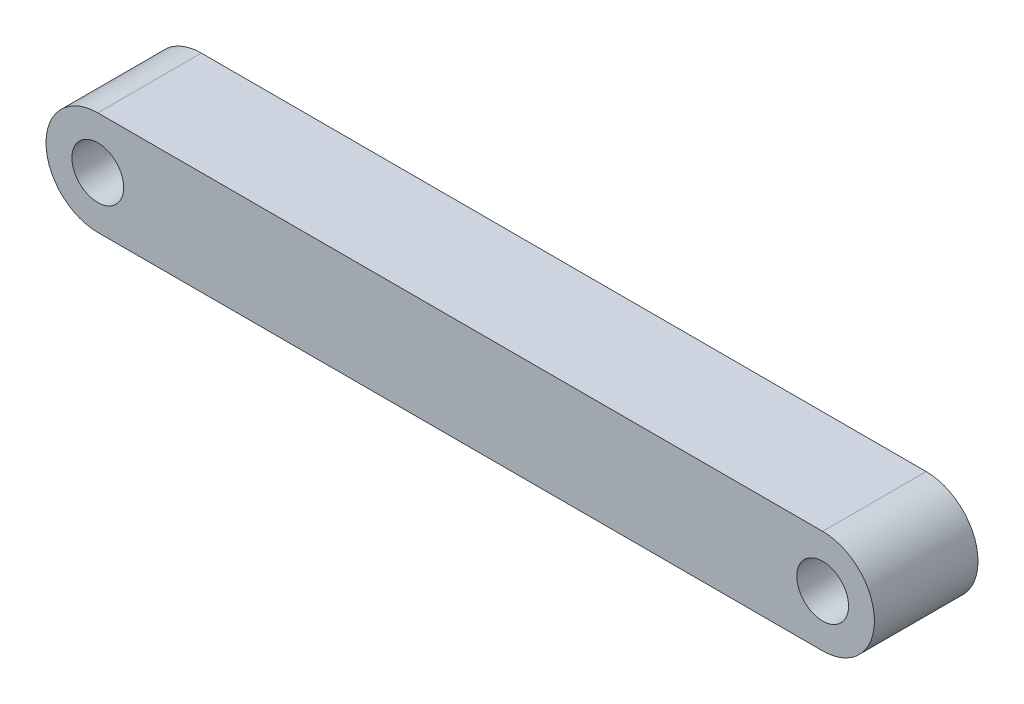
ISO-10303-21;
HEADER;
FILE_DESCRIPTION(('STEP AP214'),'2;1');
FILE_NAME('part.step','',(''),(''),'','','');
FILE_SCHEMA(('AUTOMOTIVE_DESIGN { 1 0 10303 214 1 1 1 1 }'));
ENDSEC;
DATA;
#1=APPLICATION_CONTEXT('core data for automotive mechanical design processes');
#2=APPLICATION_PROTOCOL_DEFINITION('international standard','automotive_design',2000,#1);
#3=PRODUCT_CONTEXT('',#1,'mechanical');
#4=PRODUCT('Part','Part','',(#3));
#5=PRODUCT_RELATED_PRODUCT_CATEGORY('part','',(#4));
#6=PRODUCT_DEFINITION_FORMATION('','',#4);
#7=PRODUCT_DEFINITION_CONTEXT('part definition',#1,'design');
#8=PRODUCT_DEFINITION('design','',#6,#7);
#9=PRODUCT_DEFINITION_SHAPE('','',#8);
#10=(LENGTH_UNIT() NAMED_UNIT(*) SI_UNIT(.MILLI.,.METRE.));
#11=(NAMED_UNIT(*) PLANE_ANGLE_UNIT() SI_UNIT($,.RADIAN.));
#12=(NAMED_UNIT(*) SI_UNIT($,.STERADIAN.) SOLID_ANGLE_UNIT());
#13=UNCERTAINTY_MEASURE_WITH_UNIT(LENGTH_MEASURE(1.E-05),#10,'distance_accuracy_value','');
#14=(GEOMETRIC_REPRESENTATION_CONTEXT(3) GLOBAL_UNCERTAINTY_ASSIGNED_CONTEXT((#13)) GLOBAL_UNIT_ASSIGNED_CONTEXT((#10,
#11,#12)) REPRESENTATION_CONTEXT('',''));
#15=CARTESIAN_POINT('',(0.,0.,0.));
#16=DIRECTION('',(0.,0.,1.));
#17=DIRECTION('',(1.,0.,0.));
#18=AXIS2_PLACEMENT_3D('',#15,#16,#17);
#19=CARTESIAN_POINT('',(-35.,0.,10.));
#20=DIRECTION('',(0.,0.,1.));
#21=DIRECTION('',(1.,0.,0.));
#22=AXIS2_PLACEMENT_3D('',#19,#20,#21);
#23=PLANE('',#22);
#24=CARTESIAN_POINT('',(-35.,0.,10.));
#25=DIRECTION('',(0.,0.,1.));
#26=DIRECTION('',(1.,0.,0.));
#27=AXIS2_PLACEMENT_3D('',#24,#25,#26);
#28=CIRCLE('',#27,2.5);
#29=CARTESIAN_POINT('',(-32.5,0.,10.));
#30=VERTEX_POINT('',#29);
#31=EDGE_CURVE('E115',#30,#30,#28,.T.);
#32=ORIENTED_EDGE('',*,*,#31,.F.);
#33=EDGE_LOOP('',(#32));
#34=FACE_BOUND('',#33,.T.);
#35=CARTESIAN_POINT('',(-35.,0.,10.));
#36=DIRECTION('',(0.,0.,1.));
#37=DIRECTION('',(1.,0.,0.));
#38=AXIS2_PLACEMENT_3D('',#35,#36,#37);
#39=CIRCLE('',#38,5.);
#40=CARTESIAN_POINT('',(-35.,4.99999999999999,10.));
#41=VERTEX_POINT('',#40);
#42=CARTESIAN_POINT('',(-35.,-5.00000000000001,10.));
#43=VERTEX_POINT('',#42);
#44=EDGE_CURVE('E95',#41,#43,#39,.T.);
#45=ORIENTED_EDGE('',*,*,#44,.T.);
#46=DIRECTION('',(1.,0.,0.));
#47=VECTOR('',#46,1.);
#48=CARTESIAN_POINT('',(-35.,-5.00000000000001,10.));
#49=LINE('',#48,#47);
#50=CARTESIAN_POINT('',(35.,-5.00000000000001,10.));
#51=VERTEX_POINT('',#50);
#52=EDGE_CURVE('E90',#43,#51,#49,.T.);
#53=ORIENTED_EDGE('',*,*,#52,.T.);
#54=CARTESIAN_POINT('',(35.,0.,10.));
#55=DIRECTION('',(0.,0.,1.));
#56=DIRECTION('',(1.,0.,0.));
#57=AXIS2_PLACEMENT_3D('',#54,#55,#56);
#58=CIRCLE('',#57,5.);
#59=CARTESIAN_POINT('',(35.,4.99999999999999,10.));
#60=VERTEX_POINT('',#59);
#61=EDGE_CURVE('E93',#51,#60,#58,.T.);
#62=ORIENTED_EDGE('',*,*,#61,.T.);
#63=DIRECTION('',(-1.,0.,0.));
#64=VECTOR('',#63,1.);
#65=CARTESIAN_POINT('',(-35.,4.99999999999999,10.));
#66=LINE('',#65,#64);
#67=EDGE_CURVE('E60',#60,#41,#66,.T.);
#68=ORIENTED_EDGE('',*,*,#67,.T.);
#69=EDGE_LOOP('',(#45,#53,#62,#68));
#70=FACE_BOUND('',#69,.T.);
#71=CARTESIAN_POINT('',(35.,0.,10.));
#72=DIRECTION('',(0.,0.,1.));
#73=DIRECTION('',(1.,0.,0.));
#74=AXIS2_PLACEMENT_3D('',#71,#72,#73);
#75=CIRCLE('',#74,2.50000000000001);
#76=CARTESIAN_POINT('',(37.5,0.,10.));
#77=VERTEX_POINT('',#76);
#78=EDGE_CURVE('E137',#77,#77,#75,.T.);
#79=ORIENTED_EDGE('',*,*,#78,.F.);
#80=EDGE_LOOP('',(#79));
#81=FACE_BOUND('',#80,.T.);
#82=ADVANCED_FACE('F42',(#34,#70,#81),#23,.T.);
#83=CARTESIAN_POINT('',(-35.,0.,0.));
#84=DIRECTION('',(0.,0.,1.));
#85=DIRECTION('',(1.,0.,0.));
#86=AXIS2_PLACEMENT_3D('',#83,#84,#85);
#87=PLANE('',#86);
#88=CARTESIAN_POINT('',(-35.,0.,0.));
#89=DIRECTION('',(0.,0.,1.));
#90=DIRECTION('',(1.,0.,0.));
#91=AXIS2_PLACEMENT_3D('',#88,#89,#90);
#92=CIRCLE('',#91,5.);
#93=CARTESIAN_POINT('',(-35.,4.99999999999999,0.));
#94=VERTEX_POINT('',#93);
#95=CARTESIAN_POINT('',(-35.,-5.00000000000001,0.));
#96=VERTEX_POINT('',#95);
#97=EDGE_CURVE('E111',#94,#96,#92,.T.);
#98=ORIENTED_EDGE('',*,*,#97,.F.);
#99=DIRECTION('',(-1.,0.,0.));
#100=VECTOR('',#99,1.);
#101=CARTESIAN_POINT('',(-35.,4.99999999999999,0.));
#102=LINE('',#101,#100);
#103=CARTESIAN_POINT('',(35.,4.99999999999999,0.));
#104=VERTEX_POINT('',#103);
#105=EDGE_CURVE('E83',#104,#94,#102,.T.);
#106=ORIENTED_EDGE('',*,*,#105,.F.);
#107=CARTESIAN_POINT('',(35.,0.,0.));
#108=DIRECTION('',(0.,0.,1.));
#109=DIRECTION('',(1.,0.,0.));
#110=AXIS2_PLACEMENT_3D('',#107,#108,#109);
#111=CIRCLE('',#110,5.);
#112=CARTESIAN_POINT('',(35.,-5.00000000000001,0.));
#113=VERTEX_POINT('',#112);
#114=EDGE_CURVE('E77',#113,#104,#111,.T.);
#115=ORIENTED_EDGE('',*,*,#114,.F.);
#116=DIRECTION('',(1.,0.,0.));
#117=VECTOR('',#116,1.);
#118=CARTESIAN_POINT('',(-35.,-5.00000000000001,0.));
#119=LINE('',#118,#117);
#120=EDGE_CURVE('E100',#96,#113,#119,.T.);
#121=ORIENTED_EDGE('',*,*,#120,.F.);
#122=EDGE_LOOP('',(#98,#106,#115,#121));
#123=FACE_BOUND('',#122,.T.);
#124=CARTESIAN_POINT('',(-35.,0.,0.));
#125=DIRECTION('',(0.,0.,1.));
#126=DIRECTION('',(1.,0.,0.));
#127=AXIS2_PLACEMENT_3D('',#124,#125,#126);
#128=CIRCLE('',#127,2.5);
#129=CARTESIAN_POINT('',(-32.5,0.,0.));
#130=VERTEX_POINT('',#129);
#131=EDGE_CURVE('E133',#130,#130,#128,.T.);
#132=ORIENTED_EDGE('',*,*,#131,.T.);
#133=EDGE_LOOP('',(#132));
#134=FACE_BOUND('',#133,.T.);
#135=CARTESIAN_POINT('',(35.,0.,0.));
#136=DIRECTION('',(0.,0.,1.));
#137=DIRECTION('',(1.,0.,0.));
#138=AXIS2_PLACEMENT_3D('',#135,#136,#137);
#139=CIRCLE('',#138,2.50000000000001);
#140=CARTESIAN_POINT('',(37.5,0.,0.));
#141=VERTEX_POINT('',#140);
#142=EDGE_CURVE('E141',#141,#141,#139,.T.);
#143=ORIENTED_EDGE('',*,*,#142,.T.);
#144=EDGE_LOOP('',(#143));
#145=FACE_BOUND('',#144,.T.);
#146=ADVANCED_FACE('F128',(#123,#134,#145),#87,.F.);
#147=CARTESIAN_POINT('',(-35.,0.,10.));
#148=DIRECTION('',(0.,0.,-1.));
#149=DIRECTION('',(-1.,0.,0.));
#150=AXIS2_PLACEMENT_3D('',#147,#148,#149);
#151=CYLINDRICAL_SURFACE('',#150,5.);
#152=ORIENTED_EDGE('',*,*,#97,.T.);
#153=DIRECTION('',(0.,0.,-1.));
#154=VECTOR('',#153,1.);
#155=CARTESIAN_POINT('',(-35.,-5.00000000000001,10.));
#156=LINE('',#155,#154);
#157=EDGE_CURVE('E11',#43,#96,#156,.T.);
#158=ORIENTED_EDGE('',*,*,#157,.F.);
#159=ORIENTED_EDGE('',*,*,#44,.F.);
#160=DIRECTION('',(0.,0.,-1.));
#161=VECTOR('',#160,1.);
#162=CARTESIAN_POINT('',(-35.,4.99999999999999,10.));
#163=LINE('',#162,#161);
#164=EDGE_CURVE('E107',#41,#94,#163,.T.);
#165=ORIENTED_EDGE('',*,*,#164,.T.);
#166=EDGE_LOOP('',(#152,#158,#159,#165));
#167=FACE_BOUND('',#166,.T.);
#168=ADVANCED_FACE('F44',(#167),#151,.T.);
#169=CARTESIAN_POINT('',(-35.,-5.00000000000001,10.));
#170=DIRECTION('',(0.,1.,0.));
#171=DIRECTION('',(-1.,0.,0.));
#172=AXIS2_PLACEMENT_3D('',#169,#170,#171);
#173=PLANE('',#172);
#174=ORIENTED_EDGE('',*,*,#120,.T.);
#175=DIRECTION('',(0.,0.,-1.));
#176=VECTOR('',#175,1.);
#177=CARTESIAN_POINT('',(35.,-5.00000000000001,10.));
#178=LINE('',#177,#176);
#179=EDGE_CURVE('E52',#51,#113,#178,.T.);
#180=ORIENTED_EDGE('',*,*,#179,.F.);
#181=ORIENTED_EDGE('',*,*,#52,.F.);
#182=ORIENTED_EDGE('',*,*,#157,.T.);
#183=EDGE_LOOP('',(#174,#180,#181,#182));
#184=FACE_BOUND('',#183,.T.);
#185=ADVANCED_FACE('F99',(#184),#173,.F.);
#186=CARTESIAN_POINT('',(35.,0.,10.));
#187=DIRECTION('',(0.,0.,-1.));
#188=DIRECTION('',(-1.,0.,0.));
#189=AXIS2_PLACEMENT_3D('',#186,#187,#188);
#190=CYLINDRICAL_SURFACE('',#189,5.);
#191=ORIENTED_EDGE('',*,*,#114,.T.);
#192=DIRECTION('',(0.,0.,-1.));
#193=VECTOR('',#192,1.);
#194=CARTESIAN_POINT('',(35.,4.99999999999999,10.));
#195=LINE('',#194,#193);
#196=EDGE_CURVE('E102',#60,#104,#195,.T.);
#197=ORIENTED_EDGE('',*,*,#196,.F.);
#198=ORIENTED_EDGE('',*,*,#61,.F.);
#199=ORIENTED_EDGE('',*,*,#179,.T.);
#200=EDGE_LOOP('',(#191,#197,#198,#199));
#201=FACE_BOUND('',#200,.T.);
#202=ADVANCED_FACE('F103',(#201),#190,.T.);
#203=CARTESIAN_POINT('',(-35.,4.99999999999999,10.));
#204=DIRECTION('',(0.,-1.,0.));
#205=DIRECTION('',(1.,0.,0.));
#206=AXIS2_PLACEMENT_3D('',#203,#204,#205);
#207=PLANE('',#206);
#208=ORIENTED_EDGE('',*,*,#105,.T.);
#209=ORIENTED_EDGE('',*,*,#164,.F.);
#210=ORIENTED_EDGE('',*,*,#67,.F.);
#211=ORIENTED_EDGE('',*,*,#196,.T.);
#212=EDGE_LOOP('',(#208,#209,#210,#211));
#213=FACE_BOUND('',#212,.T.);
#214=ADVANCED_FACE('F125',(#213),#207,.F.);
#215=CARTESIAN_POINT('',(-35.,0.,10.));
#216=DIRECTION('',(0.,0.,-1.));
#217=DIRECTION('',(-1.,0.,0.));
#218=AXIS2_PLACEMENT_3D('',#215,#216,#217);
#219=CYLINDRICAL_SURFACE('',#218,2.5);
#220=ORIENTED_EDGE('',*,*,#31,.T.);
#221=EDGE_LOOP('',(#220));
#222=FACE_BOUND('',#221,.T.);
#223=ORIENTED_EDGE('',*,*,#131,.F.);
#224=EDGE_LOOP('',(#223));
#225=FACE_BOUND('',#224,.T.);
#226=ADVANCED_FACE('F160',(#222,#225),#219,.F.);
#227=CARTESIAN_POINT('',(35.,0.,10.));
#228=DIRECTION('',(0.,0.,-1.));
#229=DIRECTION('',(-1.,0.,0.));
#230=AXIS2_PLACEMENT_3D('',#227,#228,#229);
#231=CYLINDRICAL_SURFACE('',#230,2.50000000000001);
#232=ORIENTED_EDGE('',*,*,#78,.T.);
#233=EDGE_LOOP('',(#232));
#234=FACE_BOUND('',#233,.T.);
#235=ORIENTED_EDGE('',*,*,#142,.F.);
#236=EDGE_LOOP('',(#235));
#237=FACE_BOUND('',#236,.T.);
#238=ADVANCED_FACE('F149',(#234,#237),#231,.F.);
#239=CLOSED_SHELL('',(#82,#146,#168,#185,#202,#214,#226,#238));
#240=MANIFOLD_SOLID_BREP('B2',#239);
#241=ADVANCED_BREP_SHAPE_REPRESENTATION('',(#18,#240),#14);
#242=SHAPE_DEFINITION_REPRESENTATION(#9,#241);
ENDSEC;
END-ISO-10303-21;
